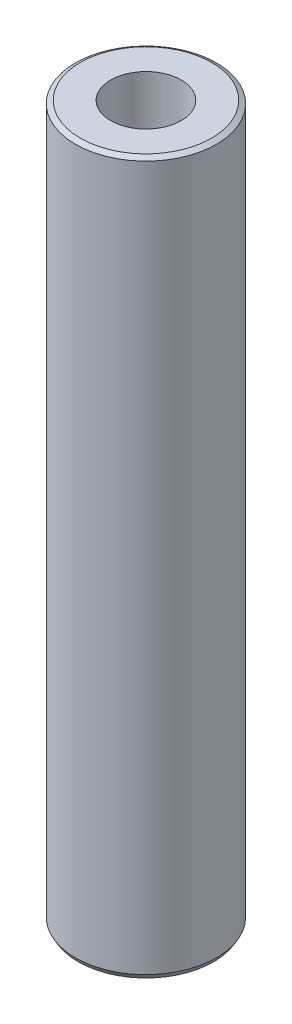
ISO-10303-21;
HEADER;
FILE_DESCRIPTION(('STEP AP214'),'2;1');
FILE_NAME('part.step','',(''),(''),'','','');
FILE_SCHEMA(('AUTOMOTIVE_DESIGN { 1 0 10303 214 1 1 1 1 }'));
ENDSEC;
DATA;
#1=APPLICATION_CONTEXT('core data for automotive mechanical design processes');
#2=APPLICATION_PROTOCOL_DEFINITION('international standard','automotive_design',2000,#1);
#3=PRODUCT_CONTEXT('',#1,'mechanical');
#4=PRODUCT('Part','Part','',(#3));
#5=PRODUCT_RELATED_PRODUCT_CATEGORY('part','',(#4));
#6=PRODUCT_DEFINITION_FORMATION('','',#4);
#7=PRODUCT_DEFINITION_CONTEXT('part definition',#1,'design');
#8=PRODUCT_DEFINITION('design','',#6,#7);
#9=PRODUCT_DEFINITION_SHAPE('','',#8);
#10=(LENGTH_UNIT() NAMED_UNIT(*) SI_UNIT(.MILLI.,.METRE.));
#11=(NAMED_UNIT(*) PLANE_ANGLE_UNIT() SI_UNIT($,.RADIAN.));
#12=(NAMED_UNIT(*) SI_UNIT($,.STERADIAN.) SOLID_ANGLE_UNIT());
#13=UNCERTAINTY_MEASURE_WITH_UNIT(LENGTH_MEASURE(1.E-05),#10,'distance_accuracy_value','');
#14=(GEOMETRIC_REPRESENTATION_CONTEXT(3) GLOBAL_UNCERTAINTY_ASSIGNED_CONTEXT((#13)) GLOBAL_UNIT_ASSIGNED_CONTEXT((#10,
#11,#12)) REPRESENTATION_CONTEXT('',''));
#15=CARTESIAN_POINT('',(0.,0.,0.));
#16=DIRECTION('',(0.,0.,1.));
#17=DIRECTION('',(1.,0.,0.));
#18=AXIS2_PLACEMENT_3D('',#15,#16,#17);
#19=CARTESIAN_POINT('',(0.,25.25,0.));
#20=DIRECTION('',(0.,-1.,0.));
#21=DIRECTION('',(0.,0.,-1.));
#22=AXIS2_PLACEMENT_3D('',#19,#20,#21);
#23=CYLINDRICAL_SURFACE('',#22,2.5);
#24=CARTESIAN_POINT('',(0.,0.173205080756886,0.));
#25=DIRECTION('',(0.,1.,0.));
#26=DIRECTION('',(0.,0.,1.));
#27=AXIS2_PLACEMENT_3D('',#24,#25,#26);
#28=CIRCLE('',#27,2.5);
#29=CARTESIAN_POINT('',(0.,0.173205080756886,2.5));
#30=VERTEX_POINT('',#29);
#31=EDGE_CURVE('E49',#30,#30,#28,.T.);
#32=ORIENTED_EDGE('',*,*,#31,.T.);
#33=EDGE_LOOP('',(#32));
#34=FACE_BOUND('',#33,.T.);
#35=CARTESIAN_POINT('',(0.,25.15,0.));
#36=DIRECTION('',(0.,1.,0.));
#37=DIRECTION('',(0.,0.,1.));
#38=AXIS2_PLACEMENT_3D('',#35,#36,#37);
#39=CIRCLE('',#38,2.5);
#40=CARTESIAN_POINT('',(0.,25.15,2.5));
#41=VERTEX_POINT('',#40);
#42=EDGE_CURVE('E53',#41,#41,#39,.F.);
#43=ORIENTED_EDGE('',*,*,#42,.T.);
#44=EDGE_LOOP('',(#43));
#45=FACE_BOUND('',#44,.T.);
#46=ADVANCED_FACE('F37',(#34,#45),#23,.T.);
#47=CARTESIAN_POINT('',(0.,25.25,0.));
#48=DIRECTION('',(0.,1.,0.));
#49=DIRECTION('',(0.,0.,1.));
#50=AXIS2_PLACEMENT_3D('',#47,#48,#49);
#51=PLANE('',#50);
#52=CARTESIAN_POINT('',(0.,25.25,0.));
#53=DIRECTION('',(0.,1.,0.));
#54=DIRECTION('',(0.,0.,1.));
#55=AXIS2_PLACEMENT_3D('',#52,#53,#54);
#56=CIRCLE('',#55,1.24999999999999);
#57=CARTESIAN_POINT('',(0.,25.25,1.24999999999999));
#58=VERTEX_POINT('',#57);
#59=EDGE_CURVE('E61',#58,#58,#56,.T.);
#60=ORIENTED_EDGE('',*,*,#59,.F.);
#61=EDGE_LOOP('',(#60));
#62=FACE_BOUND('',#61,.T.);
#63=CARTESIAN_POINT('',(0.,25.25,0.));
#64=DIRECTION('',(0.,1.,0.));
#65=DIRECTION('',(0.,0.,1.));
#66=AXIS2_PLACEMENT_3D('',#63,#64,#65);
#67=CIRCLE('',#66,2.32679491924311);
#68=CARTESIAN_POINT('',(0.,25.25,2.32679491924311));
#69=VERTEX_POINT('',#68);
#70=EDGE_CURVE('E10',#69,#69,#67,.T.);
#71=ORIENTED_EDGE('',*,*,#70,.T.);
#72=EDGE_LOOP('',(#71));
#73=FACE_BOUND('',#72,.T.);
#74=ADVANCED_FACE('F67',(#62,#73),#51,.T.);
#75=CARTESIAN_POINT('',(0.,0.,0.));
#76=DIRECTION('',(0.,1.,0.));
#77=DIRECTION('',(0.,0.,1.));
#78=AXIS2_PLACEMENT_3D('',#75,#76,#77);
#79=PLANE('',#78);
#80=CARTESIAN_POINT('',(0.,0.,0.));
#81=DIRECTION('',(0.,1.,0.));
#82=DIRECTION('',(0.,0.,1.));
#83=AXIS2_PLACEMENT_3D('',#80,#81,#82);
#84=CIRCLE('',#83,1.24999999999999);
#85=CARTESIAN_POINT('',(0.,0.,1.24999999999999));
#86=VERTEX_POINT('',#85);
#87=EDGE_CURVE('E58',#86,#86,#84,.T.);
#88=ORIENTED_EDGE('',*,*,#87,.T.);
#89=EDGE_LOOP('',(#88));
#90=FACE_BOUND('',#89,.T.);
#91=CARTESIAN_POINT('',(0.,0.,0.));
#92=DIRECTION('',(0.,1.,0.));
#93=DIRECTION('',(0.,0.,1.));
#94=AXIS2_PLACEMENT_3D('',#91,#92,#93);
#95=CIRCLE('',#94,2.4);
#96=CARTESIAN_POINT('',(0.,0.,2.4));
#97=VERTEX_POINT('',#96);
#98=EDGE_CURVE('E45',#97,#97,#95,.F.);
#99=ORIENTED_EDGE('',*,*,#98,.T.);
#100=EDGE_LOOP('',(#99));
#101=FACE_BOUND('',#100,.T.);
#102=ADVANCED_FACE('F69',(#90,#101),#79,.F.);
#103=CARTESIAN_POINT('',(0.,0.173205080756886,0.));
#104=DIRECTION('',(0.,1.,0.));
#105=DIRECTION('',(0.,0.,1.));
#106=AXIS2_PLACEMENT_3D('',#103,#104,#105);
#107=CONICAL_SURFACE('',#106,2.5,0.523598775598303);
#108=ORIENTED_EDGE('',*,*,#98,.F.);
#109=EDGE_LOOP('',(#108));
#110=FACE_BOUND('',#109,.T.);
#111=ORIENTED_EDGE('',*,*,#31,.F.);
#112=EDGE_LOOP('',(#111));
#113=FACE_BOUND('',#112,.T.);
#114=ADVANCED_FACE('F75',(#110,#113),#107,.T.);
#115=CARTESIAN_POINT('',(0.,25.25,0.));
#116=DIRECTION('',(0.,-1.,0.));
#117=DIRECTION('',(0.,0.,-1.));
#118=AXIS2_PLACEMENT_3D('',#115,#116,#117);
#119=CONICAL_SURFACE('',#118,2.32679491924311,1.0471975511966);
#120=ORIENTED_EDGE('',*,*,#42,.F.);
#121=EDGE_LOOP('',(#120));
#122=FACE_BOUND('',#121,.T.);
#123=ORIENTED_EDGE('',*,*,#70,.F.);
#124=EDGE_LOOP('',(#123));
#125=FACE_BOUND('',#124,.T.);
#126=ADVANCED_FACE('F40',(#122,#125),#119,.T.);
#127=CARTESIAN_POINT('',(0.,25.25,0.));
#128=DIRECTION('',(0.,1.,0.));
#129=DIRECTION('',(0.,0.,1.));
#130=AXIS2_PLACEMENT_3D('',#127,#128,#129);
#131=CYLINDRICAL_SURFACE('',#130,1.24999999999999);
#132=ORIENTED_EDGE('',*,*,#87,.F.);
#133=EDGE_LOOP('',(#132));
#134=FACE_BOUND('',#133,.T.);
#135=ORIENTED_EDGE('',*,*,#59,.T.);
#136=EDGE_LOOP('',(#135));
#137=FACE_BOUND('',#136,.T.);
#138=ADVANCED_FACE('F65',(#134,#137),#131,.F.);
#139=CLOSED_SHELL('',(#46,#74,#102,#114,#126,#138));
#140=MANIFOLD_SOLID_BREP('B2',#139);
#141=ADVANCED_BREP_SHAPE_REPRESENTATION('',(#18,#140),#14);
#142=SHAPE_DEFINITION_REPRESENTATION(#9,#141);
ENDSEC;
END-ISO-10303-21;
